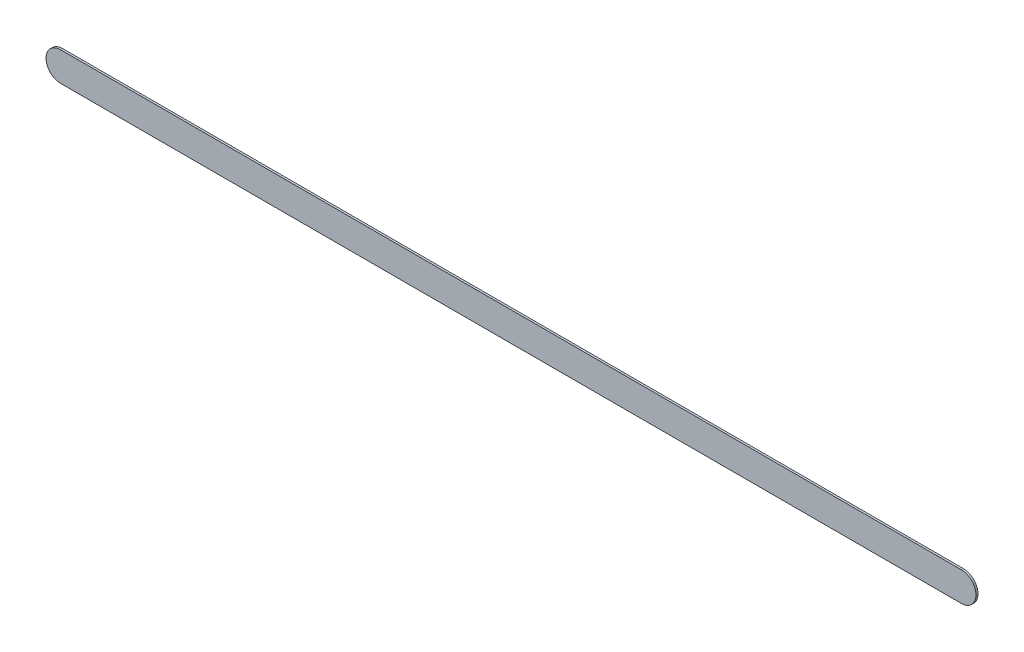
ISO-10303-21;
HEADER;
FILE_DESCRIPTION(('STEP AP214'),'2;1');
FILE_NAME('part.step','',(''),(''),'','','');
FILE_SCHEMA(('AUTOMOTIVE_DESIGN { 1 0 10303 214 1 1 1 1 }'));
ENDSEC;
DATA;
#1=APPLICATION_CONTEXT('core data for automotive mechanical design processes');
#2=APPLICATION_PROTOCOL_DEFINITION('international standard','automotive_design',2000,#1);
#3=PRODUCT_CONTEXT('',#1,'mechanical');
#4=PRODUCT('Part','Part','',(#3));
#5=PRODUCT_RELATED_PRODUCT_CATEGORY('part','',(#4));
#6=PRODUCT_DEFINITION_FORMATION('','',#4);
#7=PRODUCT_DEFINITION_CONTEXT('part definition',#1,'design');
#8=PRODUCT_DEFINITION('design','',#6,#7);
#9=PRODUCT_DEFINITION_SHAPE('','',#8);
#10=(LENGTH_UNIT() NAMED_UNIT(*) SI_UNIT(.MILLI.,.METRE.));
#11=(NAMED_UNIT(*) PLANE_ANGLE_UNIT() SI_UNIT($,.RADIAN.));
#12=(NAMED_UNIT(*) SI_UNIT($,.STERADIAN.) SOLID_ANGLE_UNIT());
#13=UNCERTAINTY_MEASURE_WITH_UNIT(LENGTH_MEASURE(1.E-05),#10,'distance_accuracy_value','');
#14=(GEOMETRIC_REPRESENTATION_CONTEXT(3) GLOBAL_UNCERTAINTY_ASSIGNED_CONTEXT((#13)) GLOBAL_UNIT_ASSIGNED_CONTEXT((#10,
#11,#12)) REPRESENTATION_CONTEXT('',''));
#15=CARTESIAN_POINT('',(0.,0.,0.));
#16=DIRECTION('',(0.,0.,1.));
#17=DIRECTION('',(1.,0.,0.));
#18=AXIS2_PLACEMENT_3D('',#15,#16,#17);
#19=CARTESIAN_POINT('',(142.9512,-74.934,0.));
#20=DIRECTION('',(0.,0.,1.));
#21=DIRECTION('',(1.,0.,0.));
#22=AXIS2_PLACEMENT_3D('',#19,#20,#21);
#23=PLANE('',#22);
#24=DIRECTION('',(-1.,0.,0.));
#25=VECTOR('',#24,1.);
#26=CARTESIAN_POINT('',(142.9512,-74.934,0.));
#27=LINE('',#26,#25);
#28=CARTESIAN_POINT('',(142.9512,-74.934,0.));
#29=VERTEX_POINT('',#28);
#30=CARTESIAN_POINT('',(127.508,-74.934,0.));
#31=VERTEX_POINT('',#30);
#32=EDGE_CURVE('E81',#29,#31,#27,.T.);
#33=ORIENTED_EDGE('',*,*,#32,.T.);
#34=CARTESIAN_POINT('',(127.508,-75.184,0.));
#35=DIRECTION('',(0.,0.,1.));
#36=DIRECTION('',(0.,1.,0.));
#37=AXIS2_PLACEMENT_3D('',#34,#35,#36);
#38=CIRCLE('',#37,0.25);
#39=CARTESIAN_POINT('',(127.508,-75.434,0.));
#40=VERTEX_POINT('',#39);
#41=EDGE_CURVE('E108',#31,#40,#38,.T.);
#42=ORIENTED_EDGE('',*,*,#41,.T.);
#43=DIRECTION('',(1.,0.,0.));
#44=VECTOR('',#43,1.);
#45=CARTESIAN_POINT('',(127.508,-75.434,0.));
#46=LINE('',#45,#44);
#47=CARTESIAN_POINT('',(142.9512,-75.434,0.));
#48=VERTEX_POINT('',#47);
#49=EDGE_CURVE('E74',#40,#48,#46,.T.);
#50=ORIENTED_EDGE('',*,*,#49,.T.);
#51=CARTESIAN_POINT('',(142.9512,-75.184,0.));
#52=DIRECTION('',(0.,0.,1.));
#53=DIRECTION('',(0.,-1.,0.));
#54=AXIS2_PLACEMENT_3D('',#51,#52,#53);
#55=CIRCLE('',#54,0.25);
#56=EDGE_CURVE('E11',#48,#29,#55,.T.);
#57=ORIENTED_EDGE('',*,*,#56,.T.);
#58=EDGE_LOOP('',(#33,#42,#50,#57));
#59=FACE_BOUND('',#58,.T.);
#60=ADVANCED_FACE('F17',(#59),#23,.T.);
#61=CARTESIAN_POINT('',(142.9512,-74.934,-0.035));
#62=DIRECTION('',(0.,0.,1.));
#63=DIRECTION('',(1.,0.,0.));
#64=AXIS2_PLACEMENT_3D('',#61,#62,#63);
#65=PLANE('',#64);
#66=CARTESIAN_POINT('',(142.9512,-75.184,-0.035));
#67=DIRECTION('',(0.,0.,1.));
#68=DIRECTION('',(0.,-1.,0.));
#69=AXIS2_PLACEMENT_3D('',#66,#67,#68);
#70=CIRCLE('',#69,0.25);
#71=CARTESIAN_POINT('',(142.9512,-75.434,-0.035));
#72=VERTEX_POINT('',#71);
#73=CARTESIAN_POINT('',(142.9512,-74.934,-0.035));
#74=VERTEX_POINT('',#73);
#75=EDGE_CURVE('E25',#72,#74,#70,.T.);
#76=ORIENTED_EDGE('',*,*,#75,.F.);
#77=DIRECTION('',(1.,0.,0.));
#78=VECTOR('',#77,1.);
#79=CARTESIAN_POINT('',(127.508,-75.434,-0.035));
#80=LINE('',#79,#78);
#81=CARTESIAN_POINT('',(127.508,-75.434,-0.035));
#82=VERTEX_POINT('',#81);
#83=EDGE_CURVE('E101',#82,#72,#80,.T.);
#84=ORIENTED_EDGE('',*,*,#83,.F.);
#85=CARTESIAN_POINT('',(127.508,-75.184,-0.035));
#86=DIRECTION('',(0.,0.,1.));
#87=DIRECTION('',(0.,1.,0.));
#88=AXIS2_PLACEMENT_3D('',#85,#86,#87);
#89=CIRCLE('',#88,0.25);
#90=CARTESIAN_POINT('',(127.508,-74.934,-0.035));
#91=VERTEX_POINT('',#90);
#92=EDGE_CURVE('E83',#91,#82,#89,.T.);
#93=ORIENTED_EDGE('',*,*,#92,.F.);
#94=DIRECTION('',(-1.,0.,0.));
#95=VECTOR('',#94,1.);
#96=CARTESIAN_POINT('',(142.9512,-74.934,-0.035));
#97=LINE('',#96,#95);
#98=EDGE_CURVE('E79',#74,#91,#97,.T.);
#99=ORIENTED_EDGE('',*,*,#98,.F.);
#100=EDGE_LOOP('',(#76,#84,#93,#99));
#101=FACE_BOUND('',#100,.T.);
#102=ADVANCED_FACE('F85',(#101),#65,.F.);
#103=CARTESIAN_POINT('',(142.9512,-75.184,-0.035));
#104=DIRECTION('',(0.,0.,-1.));
#105=DIRECTION('',(0.,-1.,0.));
#106=AXIS2_PLACEMENT_3D('',#103,#104,#105);
#107=CYLINDRICAL_SURFACE('',#106,0.25);
#108=ORIENTED_EDGE('',*,*,#75,.T.);
#109=DIRECTION('',(0.,0.,1.));
#110=VECTOR('',#109,1.);
#111=CARTESIAN_POINT('',(142.9512,-74.934,-0.035));
#112=LINE('',#111,#110);
#113=EDGE_CURVE('E68',#74,#29,#112,.T.);
#114=ORIENTED_EDGE('',*,*,#113,.T.);
#115=ORIENTED_EDGE('',*,*,#56,.F.);
#116=DIRECTION('',(0.,0.,1.));
#117=VECTOR('',#116,1.);
#118=CARTESIAN_POINT('',(142.9512,-75.434,-0.035));
#119=LINE('',#118,#117);
#120=EDGE_CURVE('E71',#72,#48,#119,.T.);
#121=ORIENTED_EDGE('',*,*,#120,.F.);
#122=EDGE_LOOP('',(#108,#114,#115,#121));
#123=FACE_BOUND('',#122,.T.);
#124=ADVANCED_FACE('F67',(#123),#107,.T.);
#125=CARTESIAN_POINT('',(127.508,-75.434,-0.035));
#126=DIRECTION('',(0.,1.,0.));
#127=DIRECTION('',(1.,0.,0.));
#128=AXIS2_PLACEMENT_3D('',#125,#126,#127);
#129=PLANE('',#128);
#130=ORIENTED_EDGE('',*,*,#83,.T.);
#131=ORIENTED_EDGE('',*,*,#120,.T.);
#132=ORIENTED_EDGE('',*,*,#49,.F.);
#133=DIRECTION('',(0.,0.,1.));
#134=VECTOR('',#133,1.);
#135=CARTESIAN_POINT('',(127.508,-75.434,-0.035));
#136=LINE('',#135,#134);
#137=EDGE_CURVE('E103',#82,#40,#136,.T.);
#138=ORIENTED_EDGE('',*,*,#137,.F.);
#139=EDGE_LOOP('',(#130,#131,#132,#138));
#140=FACE_BOUND('',#139,.T.);
#141=ADVANCED_FACE('F119',(#140),#129,.F.);
#142=CARTESIAN_POINT('',(127.508,-75.184,-0.035));
#143=DIRECTION('',(0.,0.,-1.));
#144=DIRECTION('',(0.,1.,0.));
#145=AXIS2_PLACEMENT_3D('',#142,#143,#144);
#146=CYLINDRICAL_SURFACE('',#145,0.25);
#147=ORIENTED_EDGE('',*,*,#92,.T.);
#148=ORIENTED_EDGE('',*,*,#137,.T.);
#149=ORIENTED_EDGE('',*,*,#41,.F.);
#150=DIRECTION('',(0.,0.,1.));
#151=VECTOR('',#150,1.);
#152=CARTESIAN_POINT('',(127.508,-74.934,-0.035));
#153=LINE('',#152,#151);
#154=EDGE_CURVE('E89',#91,#31,#153,.T.);
#155=ORIENTED_EDGE('',*,*,#154,.F.);
#156=EDGE_LOOP('',(#147,#148,#149,#155));
#157=FACE_BOUND('',#156,.T.);
#158=ADVANCED_FACE('F121',(#157),#146,.T.);
#159=CARTESIAN_POINT('',(142.9512,-74.934,-0.035));
#160=DIRECTION('',(0.,-1.,0.));
#161=DIRECTION('',(0.,0.,-1.));
#162=AXIS2_PLACEMENT_3D('',#159,#160,#161);
#163=PLANE('',#162);
#164=ORIENTED_EDGE('',*,*,#98,.T.);
#165=ORIENTED_EDGE('',*,*,#154,.T.);
#166=ORIENTED_EDGE('',*,*,#32,.F.);
#167=ORIENTED_EDGE('',*,*,#113,.F.);
#168=EDGE_LOOP('',(#164,#165,#166,#167));
#169=FACE_BOUND('',#168,.T.);
#170=ADVANCED_FACE('F77',(#169),#163,.F.);
#171=CLOSED_SHELL('',(#60,#102,#124,#141,#158,#170));
#172=MANIFOLD_SOLID_BREP('B1',#171);
#173=ADVANCED_BREP_SHAPE_REPRESENTATION('',(#18,#172),#14);
#174=SHAPE_DEFINITION_REPRESENTATION(#9,#173);
ENDSEC;
END-ISO-10303-21;
